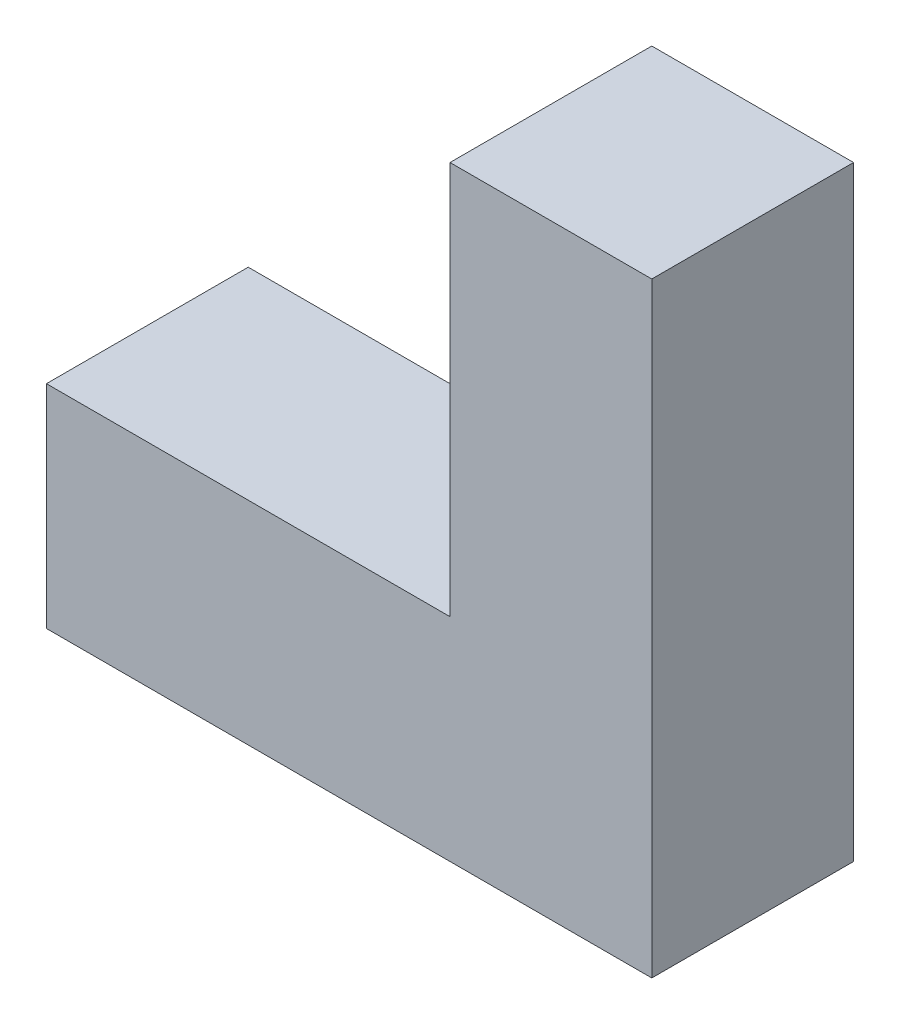
ISO-10303-21;
HEADER;
FILE_DESCRIPTION(('STEP AP214'),'2;1');
FILE_NAME('part.step','',(''),(''),'','','');
FILE_SCHEMA(('AUTOMOTIVE_DESIGN { 1 0 10303 214 1 1 1 1 }'));
ENDSEC;
DATA;
#1=APPLICATION_CONTEXT('core data for automotive mechanical design processes');
#2=APPLICATION_PROTOCOL_DEFINITION('international standard','automotive_design',2000,#1);
#3=PRODUCT_CONTEXT('',#1,'mechanical');
#4=PRODUCT('Part','Part','',(#3));
#5=PRODUCT_RELATED_PRODUCT_CATEGORY('part','',(#4));
#6=PRODUCT_DEFINITION_FORMATION('','',#4);
#7=PRODUCT_DEFINITION_CONTEXT('part definition',#1,'design');
#8=PRODUCT_DEFINITION('design','',#6,#7);
#9=PRODUCT_DEFINITION_SHAPE('','',#8);
#10=(LENGTH_UNIT() NAMED_UNIT(*) SI_UNIT(.MILLI.,.METRE.));
#11=(NAMED_UNIT(*) PLANE_ANGLE_UNIT() SI_UNIT($,.RADIAN.));
#12=(NAMED_UNIT(*) SI_UNIT($,.STERADIAN.) SOLID_ANGLE_UNIT());
#13=UNCERTAINTY_MEASURE_WITH_UNIT(LENGTH_MEASURE(1.E-05),#10,'distance_accuracy_value','');
#14=(GEOMETRIC_REPRESENTATION_CONTEXT(3) GLOBAL_UNCERTAINTY_ASSIGNED_CONTEXT((#13)) GLOBAL_UNIT_ASSIGNED_CONTEXT((#10,
#11,#12)) REPRESENTATION_CONTEXT('',''));
#15=CARTESIAN_POINT('',(0.,0.,0.));
#16=DIRECTION('',(0.,0.,1.));
#17=DIRECTION('',(1.,0.,0.));
#18=AXIS2_PLACEMENT_3D('',#15,#16,#17);
#19=CARTESIAN_POINT('',(0.,0.,15.));
#20=DIRECTION('',(0.,1.,0.));
#21=DIRECTION('',(0.,0.,1.));
#22=AXIS2_PLACEMENT_3D('',#19,#20,#21);
#23=PLANE('',#22);
#24=DIRECTION('',(1.,0.,0.));
#25=VECTOR('',#24,1.);
#26=CARTESIAN_POINT('',(0.,0.,0.));
#27=LINE('',#26,#25);
#28=CARTESIAN_POINT('',(-30.,0.,0.));
#29=VERTEX_POINT('',#28);
#30=CARTESIAN_POINT('',(15.,0.,0.));
#31=VERTEX_POINT('',#30);
#32=EDGE_CURVE('E83',#29,#31,#27,.T.);
#33=ORIENTED_EDGE('',*,*,#32,.T.);
#34=DIRECTION('',(0.,0.,-1.));
#35=VECTOR('',#34,1.);
#36=CARTESIAN_POINT('',(15.,0.,15.));
#37=LINE('',#36,#35);
#38=CARTESIAN_POINT('',(15.,0.,15.));
#39=VERTEX_POINT('',#38);
#40=EDGE_CURVE('E11',#39,#31,#37,.T.);
#41=ORIENTED_EDGE('',*,*,#40,.F.);
#42=DIRECTION('',(1.,0.,0.));
#43=VECTOR('',#42,1.);
#44=CARTESIAN_POINT('',(0.,0.,15.));
#45=LINE('',#44,#43);
#46=CARTESIAN_POINT('',(-30.,0.,15.));
#47=VERTEX_POINT('',#46);
#48=EDGE_CURVE('E89',#47,#39,#45,.T.);
#49=ORIENTED_EDGE('',*,*,#48,.F.);
#50=DIRECTION('',(0.,0.,-1.));
#51=VECTOR('',#50,1.);
#52=CARTESIAN_POINT('',(-30.,0.,15.));
#53=LINE('',#52,#51);
#54=EDGE_CURVE('E117',#47,#29,#53,.T.);
#55=ORIENTED_EDGE('',*,*,#54,.T.);
#56=EDGE_LOOP('',(#33,#41,#49,#55));
#57=FACE_BOUND('',#56,.T.);
#58=ADVANCED_FACE('F37',(#57),#23,.F.);
#59=CARTESIAN_POINT('',(15.,0.,15.));
#60=DIRECTION('',(-1.,0.,0.));
#61=DIRECTION('',(0.,-1.,0.));
#62=AXIS2_PLACEMENT_3D('',#59,#60,#61);
#63=PLANE('',#62);
#64=DIRECTION('',(0.,1.,0.));
#65=VECTOR('',#64,1.);
#66=CARTESIAN_POINT('',(15.,0.,0.));
#67=LINE('',#66,#65);
#68=CARTESIAN_POINT('',(15.,45.,0.));
#69=VERTEX_POINT('',#68);
#70=EDGE_CURVE('E122',#31,#69,#67,.T.);
#71=ORIENTED_EDGE('',*,*,#70,.T.);
#72=DIRECTION('',(0.,0.,-1.));
#73=VECTOR('',#72,1.);
#74=CARTESIAN_POINT('',(15.,45.,15.));
#75=LINE('',#74,#73);
#76=CARTESIAN_POINT('',(15.,45.,15.));
#77=VERTEX_POINT('',#76);
#78=EDGE_CURVE('E45',#77,#69,#75,.T.);
#79=ORIENTED_EDGE('',*,*,#78,.F.);
#80=DIRECTION('',(0.,1.,0.));
#81=VECTOR('',#80,1.);
#82=CARTESIAN_POINT('',(15.,0.,15.));
#83=LINE('',#82,#81);
#84=EDGE_CURVE('E144',#39,#77,#83,.T.);
#85=ORIENTED_EDGE('',*,*,#84,.F.);
#86=ORIENTED_EDGE('',*,*,#40,.T.);
#87=EDGE_LOOP('',(#71,#79,#85,#86));
#88=FACE_BOUND('',#87,.T.);
#89=ADVANCED_FACE('F147',(#88),#63,.F.);
#90=CARTESIAN_POINT('',(0.,45.,15.));
#91=DIRECTION('',(0.,-1.,0.));
#92=DIRECTION('',(0.,0.,-1.));
#93=AXIS2_PLACEMENT_3D('',#90,#91,#92);
#94=PLANE('',#93);
#95=DIRECTION('',(-1.,0.,0.));
#96=VECTOR('',#95,1.);
#97=CARTESIAN_POINT('',(0.,45.,0.));
#98=LINE('',#97,#96);
#99=CARTESIAN_POINT('',(0.,45.,0.));
#100=VERTEX_POINT('',#99);
#101=EDGE_CURVE('E124',#69,#100,#98,.T.);
#102=ORIENTED_EDGE('',*,*,#101,.T.);
#103=DIRECTION('',(0.,0.,-1.));
#104=VECTOR('',#103,1.);
#105=CARTESIAN_POINT('',(0.,45.,15.));
#106=LINE('',#105,#104);
#107=CARTESIAN_POINT('',(0.,45.,15.));
#108=VERTEX_POINT('',#107);
#109=EDGE_CURVE('E112',#108,#100,#106,.T.);
#110=ORIENTED_EDGE('',*,*,#109,.F.);
#111=DIRECTION('',(-1.,0.,0.));
#112=VECTOR('',#111,1.);
#113=CARTESIAN_POINT('',(0.,45.,15.));
#114=LINE('',#113,#112);
#115=EDGE_CURVE('E103',#77,#108,#114,.T.);
#116=ORIENTED_EDGE('',*,*,#115,.F.);
#117=ORIENTED_EDGE('',*,*,#78,.T.);
#118=EDGE_LOOP('',(#102,#110,#116,#117));
#119=FACE_BOUND('',#118,.T.);
#120=ADVANCED_FACE('F137',(#119),#94,.F.);
#121=CARTESIAN_POINT('',(0.,15.761421319797,15.));
#122=DIRECTION('',(1.,0.,0.));
#123=DIRECTION('',(0.,0.,-1.));
#124=AXIS2_PLACEMENT_3D('',#121,#122,#123);
#125=PLANE('',#124);
#126=DIRECTION('',(0.,-1.,0.));
#127=VECTOR('',#126,1.);
#128=CARTESIAN_POINT('',(0.,15.761421319797,0.));
#129=LINE('',#128,#127);
#130=CARTESIAN_POINT('',(0.,15.761421319797,0.));
#131=VERTEX_POINT('',#130);
#132=EDGE_CURVE('E111',#100,#131,#129,.T.);
#133=ORIENTED_EDGE('',*,*,#132,.T.);
#134=DIRECTION('',(0.,0.,-1.));
#135=VECTOR('',#134,1.);
#136=CARTESIAN_POINT('',(0.,15.761421319797,15.));
#137=LINE('',#136,#135);
#138=CARTESIAN_POINT('',(0.,15.761421319797,15.));
#139=VERTEX_POINT('',#138);
#140=EDGE_CURVE('E108',#139,#131,#137,.T.);
#141=ORIENTED_EDGE('',*,*,#140,.F.);
#142=DIRECTION('',(0.,-1.,0.));
#143=VECTOR('',#142,1.);
#144=CARTESIAN_POINT('',(0.,15.761421319797,15.));
#145=LINE('',#144,#143);
#146=EDGE_CURVE('E97',#108,#139,#145,.T.);
#147=ORIENTED_EDGE('',*,*,#146,.F.);
#148=ORIENTED_EDGE('',*,*,#109,.T.);
#149=EDGE_LOOP('',(#133,#141,#147,#148));
#150=FACE_BOUND('',#149,.T.);
#151=ADVANCED_FACE('F109',(#150),#125,.F.);
#152=CARTESIAN_POINT('',(0.,15.761421319797,15.));
#153=DIRECTION('',(0.,-1.,0.));
#154=DIRECTION('',(1.,0.,0.));
#155=AXIS2_PLACEMENT_3D('',#152,#153,#154);
#156=PLANE('',#155);
#157=DIRECTION('',(-1.,0.,0.));
#158=VECTOR('',#157,1.);
#159=CARTESIAN_POINT('',(0.,15.761421319797,0.));
#160=LINE('',#159,#158);
#161=CARTESIAN_POINT('',(-30.,15.761421319797,0.));
#162=VERTEX_POINT('',#161);
#163=EDGE_CURVE('E76',#131,#162,#160,.T.);
#164=ORIENTED_EDGE('',*,*,#163,.T.);
#165=DIRECTION('',(0.,0.,-1.));
#166=VECTOR('',#165,1.);
#167=CARTESIAN_POINT('',(-30.,15.761421319797,15.));
#168=LINE('',#167,#166);
#169=CARTESIAN_POINT('',(-30.,15.761421319797,15.));
#170=VERTEX_POINT('',#169);
#171=EDGE_CURVE('E113',#170,#162,#168,.T.);
#172=ORIENTED_EDGE('',*,*,#171,.F.);
#173=DIRECTION('',(-1.,0.,0.));
#174=VECTOR('',#173,1.);
#175=CARTESIAN_POINT('',(0.,15.761421319797,15.));
#176=LINE('',#175,#174);
#177=EDGE_CURVE('E101',#139,#170,#176,.T.);
#178=ORIENTED_EDGE('',*,*,#177,.F.);
#179=ORIENTED_EDGE('',*,*,#140,.T.);
#180=EDGE_LOOP('',(#164,#172,#178,#179));
#181=FACE_BOUND('',#180,.T.);
#182=ADVANCED_FACE('F115',(#181),#156,.F.);
#183=CARTESIAN_POINT('',(-30.,0.,15.));
#184=DIRECTION('',(1.,0.,0.));
#185=DIRECTION('',(0.,0.,-1.));
#186=AXIS2_PLACEMENT_3D('',#183,#184,#185);
#187=PLANE('',#186);
#188=DIRECTION('',(0.,-1.,0.));
#189=VECTOR('',#188,1.);
#190=CARTESIAN_POINT('',(-30.,0.,0.));
#191=LINE('',#190,#189);
#192=EDGE_CURVE('E128',#162,#29,#191,.T.);
#193=ORIENTED_EDGE('',*,*,#192,.T.);
#194=ORIENTED_EDGE('',*,*,#54,.F.);
#195=DIRECTION('',(0.,-1.,0.));
#196=VECTOR('',#195,1.);
#197=CARTESIAN_POINT('',(-30.,0.,15.));
#198=LINE('',#197,#196);
#199=EDGE_CURVE('E53',#170,#47,#198,.T.);
#200=ORIENTED_EDGE('',*,*,#199,.F.);
#201=ORIENTED_EDGE('',*,*,#171,.T.);
#202=EDGE_LOOP('',(#193,#194,#200,#201));
#203=FACE_BOUND('',#202,.T.);
#204=ADVANCED_FACE('F142',(#203),#187,.F.);
#205=CARTESIAN_POINT('',(0.,0.,15.));
#206=DIRECTION('',(0.,0.,-1.));
#207=DIRECTION('',(-1.,0.,0.));
#208=AXIS2_PLACEMENT_3D('',#205,#206,#207);
#209=PLANE('',#208);
#210=ORIENTED_EDGE('',*,*,#48,.T.);
#211=ORIENTED_EDGE('',*,*,#84,.T.);
#212=ORIENTED_EDGE('',*,*,#115,.T.);
#213=ORIENTED_EDGE('',*,*,#146,.T.);
#214=ORIENTED_EDGE('',*,*,#177,.T.);
#215=ORIENTED_EDGE('',*,*,#199,.T.);
#216=EDGE_LOOP('',(#210,#211,#212,#213,#214,#215));
#217=FACE_BOUND('',#216,.T.);
#218=ADVANCED_FACE('F99',(#217),#209,.F.);
#219=CARTESIAN_POINT('',(0.,0.,0.));
#220=DIRECTION('',(0.,0.,-1.));
#221=DIRECTION('',(-1.,0.,0.));
#222=AXIS2_PLACEMENT_3D('',#219,#220,#221);
#223=PLANE('',#222);
#224=ORIENTED_EDGE('',*,*,#32,.F.);
#225=ORIENTED_EDGE('',*,*,#192,.F.);
#226=ORIENTED_EDGE('',*,*,#163,.F.);
#227=ORIENTED_EDGE('',*,*,#132,.F.);
#228=ORIENTED_EDGE('',*,*,#101,.F.);
#229=ORIENTED_EDGE('',*,*,#70,.F.);
#230=EDGE_LOOP('',(#224,#225,#226,#227,#228,#229));
#231=FACE_BOUND('',#230,.T.);
#232=ADVANCED_FACE('F140',(#231),#223,.T.);
#233=CLOSED_SHELL('',(#58,#89,#120,#151,#182,#204,#218,#232));
#234=MANIFOLD_SOLID_BREP('B2',#233);
#235=ADVANCED_BREP_SHAPE_REPRESENTATION('',(#18,#234),#14);
#236=SHAPE_DEFINITION_REPRESENTATION(#9,#235);
ENDSEC;
END-ISO-10303-21;
